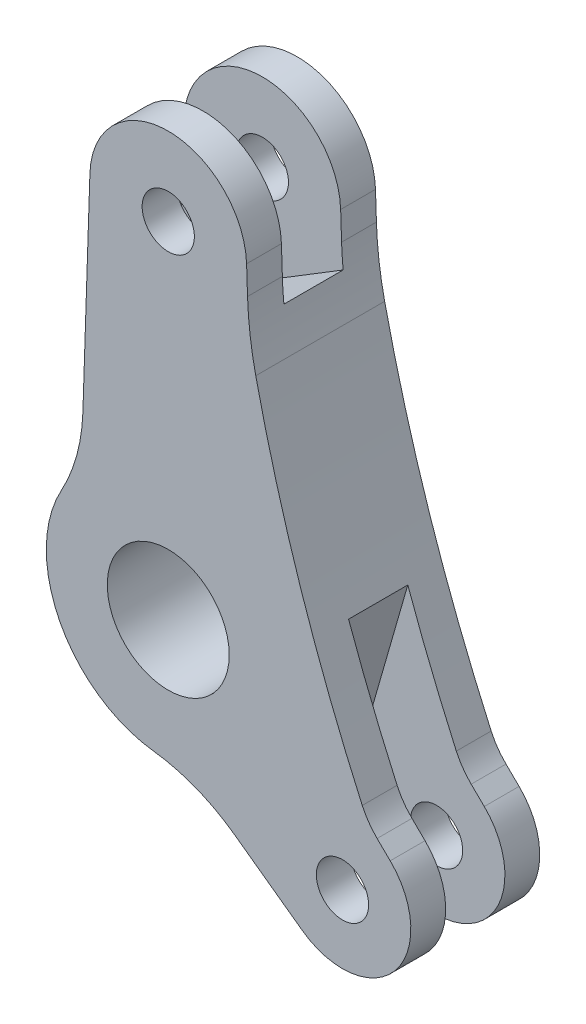
ISO-10303-21;
HEADER;
FILE_DESCRIPTION(('STEP AP214'),'2;1');
FILE_NAME('part.step','',(''),(''),'','','');
FILE_SCHEMA(('AUTOMOTIVE_DESIGN { 1 0 10303 214 1 1 1 1 }'));
ENDSEC;
DATA;
#1=APPLICATION_CONTEXT('core data for automotive mechanical design processes');
#2=APPLICATION_PROTOCOL_DEFINITION('international standard','automotive_design',2000,#1);
#3=PRODUCT_CONTEXT('',#1,'mechanical');
#4=PRODUCT('Part','Part','',(#3));
#5=PRODUCT_RELATED_PRODUCT_CATEGORY('part','',(#4));
#6=PRODUCT_DEFINITION_FORMATION('','',#4);
#7=PRODUCT_DEFINITION_CONTEXT('part definition',#1,'design');
#8=PRODUCT_DEFINITION('design','',#6,#7);
#9=PRODUCT_DEFINITION_SHAPE('','',#8);
#10=(LENGTH_UNIT() NAMED_UNIT(*) SI_UNIT(.MILLI.,.METRE.));
#11=(NAMED_UNIT(*) PLANE_ANGLE_UNIT() SI_UNIT($,.RADIAN.));
#12=(NAMED_UNIT(*) SI_UNIT($,.STERADIAN.) SOLID_ANGLE_UNIT());
#13=UNCERTAINTY_MEASURE_WITH_UNIT(LENGTH_MEASURE(1.E-05),#10,'distance_accuracy_value','');
#14=(GEOMETRIC_REPRESENTATION_CONTEXT(3) GLOBAL_UNCERTAINTY_ASSIGNED_CONTEXT((#13)) GLOBAL_UNIT_ASSIGNED_CONTEXT((#10,
#11,#12)) REPRESENTATION_CONTEXT('',''));
#15=CARTESIAN_POINT('',(0.,0.,0.));
#16=DIRECTION('',(0.,0.,1.));
#17=DIRECTION('',(1.,0.,0.));
#18=AXIS2_PLACEMENT_3D('',#15,#16,#17);
#19=CARTESIAN_POINT('',(1.89883544819038,-4.38734354159406,1.85));
#20=DIRECTION('',(0.586558009835035,0.809907217586288,0.));
#21=DIRECTION('',(-0.809907217586288,0.586558009835035,0.));
#22=AXIS2_PLACEMENT_3D('',#19,#20,#21);
#23=PLANE('',#22);
#24=DIRECTION('',(0.809907217586288,-0.586558009835035,0.));
#25=VECTOR('',#24,1.);
#26=CARTESIAN_POINT('',(1.89883544819038,-4.38734354159406,-0.85));
#27=LINE('',#26,#25);
#28=CARTESIAN_POINT('',(2.35712113183313,-4.7192471630169,-0.85));
#29=VERTEX_POINT('',#28);
#30=CARTESIAN_POINT('',(3.84954684208149,-5.80010461856446,-0.85));
#31=VERTEX_POINT('',#30);
#32=EDGE_CURVE('E246',#29,#31,#27,.T.);
#33=ORIENTED_EDGE('',*,*,#32,.F.);
#34=DIRECTION('',(0.,0.,1.));
#35=VECTOR('',#34,1.);
#36=CARTESIAN_POINT('',(2.35712113183313,-4.7192471630169,1.85));
#37=LINE('',#36,#35);
#38=CARTESIAN_POINT('',(2.35712113183313,-4.7192471630169,0.85));
#39=VERTEX_POINT('',#38);
#40=EDGE_CURVE('E208',#29,#39,#37,.T.);
#41=ORIENTED_EDGE('',*,*,#40,.T.);
#42=DIRECTION('',(0.809907217586288,-0.586558009835035,0.));
#43=VECTOR('',#42,1.);
#44=CARTESIAN_POINT('',(1.89883544819038,-4.38734354159406,0.85));
#45=LINE('',#44,#43);
#46=CARTESIAN_POINT('',(3.84954684208149,-5.80010461856446,0.85));
#47=VERTEX_POINT('',#46);
#48=EDGE_CURVE('E238',#39,#47,#45,.T.);
#49=ORIENTED_EDGE('',*,*,#48,.T.);
#50=DIRECTION('',(0.,0.,-1.));
#51=VECTOR('',#50,1.);
#52=CARTESIAN_POINT('',(3.84954684208149,-5.80010461856446,1.85));
#53=LINE('',#52,#51);
#54=CARTESIAN_POINT('',(3.84954684208149,-5.80010461856446,1.85));
#55=VERTEX_POINT('',#54);
#56=EDGE_CURVE('E43',#55,#47,#53,.T.);
#57=ORIENTED_EDGE('',*,*,#56,.F.);
#58=DIRECTION('',(0.809907217586288,-0.586558009835035,0.));
#59=VECTOR('',#58,1.);
#60=CARTESIAN_POINT('',(1.89883544819038,-4.38734354159406,1.85));
#61=LINE('',#60,#59);
#62=CARTESIAN_POINT('',(1.89883544819038,-4.38734354159406,1.85));
#63=VERTEX_POINT('',#62);
#64=EDGE_CURVE('E292',#63,#55,#61,.T.);
#65=ORIENTED_EDGE('',*,*,#64,.F.);
#66=DIRECTION('',(0.,0.,-1.));
#67=VECTOR('',#66,1.);
#68=CARTESIAN_POINT('',(1.89883544819038,-4.38734354159406,1.85));
#69=LINE('',#68,#67);
#70=CARTESIAN_POINT('',(1.89883544819038,-4.38734354159406,-1.85));
#71=VERTEX_POINT('',#70);
#72=EDGE_CURVE('E11',#63,#71,#69,.T.);
#73=ORIENTED_EDGE('',*,*,#72,.T.);
#74=DIRECTION('',(0.809907217586288,-0.586558009835035,0.));
#75=VECTOR('',#74,1.);
#76=CARTESIAN_POINT('',(1.89883544819038,-4.38734354159406,-1.85));
#77=LINE('',#76,#75);
#78=CARTESIAN_POINT('',(3.84954684208149,-5.80010461856446,-1.85));
#79=VERTEX_POINT('',#78);
#80=EDGE_CURVE('E318',#71,#79,#77,.T.);
#81=ORIENTED_EDGE('',*,*,#80,.T.);
#82=EDGE_CURVE('E380',#31,#79,#53,.T.);
#83=ORIENTED_EDGE('',*,*,#82,.F.);
#84=EDGE_LOOP('',(#33,#41,#49,#57,#65,#73,#81,#83));
#85=FACE_BOUND('',#84,.T.);
#86=ADVANCED_FACE('F34',(#85),#23,.F.);
#87=CARTESIAN_POINT('',(5.00079103651948,-4.21049034913888,1.85));
#88=DIRECTION('',(0.,0.,-1.));
#89=DIRECTION('',(-1.,0.,0.));
#90=AXIS2_PLACEMENT_3D('',#87,#88,#89);
#91=CYLINDRICAL_SURFACE('',#90,1.96271157350961);
#92=CARTESIAN_POINT('',(5.00079103651948,-4.21049034913888,-0.85));
#93=DIRECTION('',(0.,0.,1.));
#94=DIRECTION('',(1.,0.,0.));
#95=AXIS2_PLACEMENT_3D('',#92,#93,#94);
#96=CIRCLE('',#95,1.96271157350961);
#97=CARTESIAN_POINT('',(6.37107044623599,-2.80529603513973,-0.85));
#98=VERTEX_POINT('',#97);
#99=EDGE_CURVE('E244',#31,#98,#96,.T.);
#100=ORIENTED_EDGE('',*,*,#99,.F.);
#101=ORIENTED_EDGE('',*,*,#82,.T.);
#102=CARTESIAN_POINT('',(5.00079103651948,-4.21049034913888,-1.85));
#103=DIRECTION('',(0.,0.,1.));
#104=DIRECTION('',(1.,0.,0.));
#105=AXIS2_PLACEMENT_3D('',#102,#103,#104);
#106=CIRCLE('',#105,1.96271157350961);
#107=CARTESIAN_POINT('',(6.37107044623599,-2.80529603513973,-1.85));
#108=VERTEX_POINT('',#107);
#109=EDGE_CURVE('E321',#79,#108,#106,.T.);
#110=ORIENTED_EDGE('',*,*,#109,.T.);
#111=DIRECTION('',(0.,0.,-1.));
#112=VECTOR('',#111,1.);
#113=CARTESIAN_POINT('',(6.37107044623599,-2.80529603513973,1.85));
#114=LINE('',#113,#112);
#115=EDGE_CURVE('E376',#98,#108,#114,.T.);
#116=ORIENTED_EDGE('',*,*,#115,.F.);
#117=EDGE_LOOP('',(#100,#101,#110,#116));
#118=FACE_BOUND('',#117,.T.);
#119=ADVANCED_FACE('F419',(#118),#91,.T.);
#120=CARTESIAN_POINT('',(5.99474337438653,-2.43831957306836,1.85));
#121=DIRECTION('',(-0.698156279410047,-0.715945395627572,0.));
#122=DIRECTION('',(0.715945395627572,-0.698156279410047,0.));
#123=AXIS2_PLACEMENT_3D('',#120,#121,#122);
#124=PLANE('',#123);
#125=DIRECTION('',(-0.715945395627572,0.698156279410047,0.));
#126=VECTOR('',#125,1.);
#127=CARTESIAN_POINT('',(5.99474337438653,-2.43831957306836,-0.85));
#128=LINE('',#127,#126);
#129=CARTESIAN_POINT('',(5.99474337438653,-2.43831957306836,-0.85));
#130=VERTEX_POINT('',#129);
#131=EDGE_CURVE('E242',#98,#130,#128,.T.);
#132=ORIENTED_EDGE('',*,*,#131,.F.);
#133=ORIENTED_EDGE('',*,*,#115,.T.);
#134=DIRECTION('',(-0.715945395627572,0.698156279410047,0.));
#135=VECTOR('',#134,1.);
#136=CARTESIAN_POINT('',(5.99474337438653,-2.43831957306836,-1.85));
#137=LINE('',#136,#135);
#138=CARTESIAN_POINT('',(5.99474337438653,-2.43831957306836,-1.85));
#139=VERTEX_POINT('',#138);
#140=EDGE_CURVE('E324',#108,#139,#137,.T.);
#141=ORIENTED_EDGE('',*,*,#140,.T.);
#142=DIRECTION('',(0.,0.,-1.));
#143=VECTOR('',#142,1.);
#144=CARTESIAN_POINT('',(5.99474337438653,-2.43831957306836,1.85));
#145=LINE('',#144,#143);
#146=EDGE_CURVE('E372',#130,#139,#145,.T.);
#147=ORIENTED_EDGE('',*,*,#146,.F.);
#148=EDGE_LOOP('',(#132,#133,#141,#147));
#149=FACE_BOUND('',#148,.T.);
#150=ADVANCED_FACE('F424',(#149),#124,.F.);
#151=CARTESIAN_POINT('',(7.39105593320663,-1.00642878181321,1.85));
#152=DIRECTION('',(0.,0.,-1.));
#153=DIRECTION('',(-1.,0.,0.));
#154=AXIS2_PLACEMENT_3D('',#151,#152,#153);
#155=CYLINDRICAL_SURFACE('',#154,2.);
#156=CARTESIAN_POINT('',(7.39105593320663,-1.00642878181321,-0.85));
#157=DIRECTION('',(0.,0.,1.));
#158=DIRECTION('',(1.,0.,0.));
#159=AXIS2_PLACEMENT_3D('',#156,#157,#158);
#160=CIRCLE('',#159,2.);
#161=CARTESIAN_POINT('',(5.56845578497481,-1.82991448276097,-0.85));
#162=VERTEX_POINT('',#161);
#163=EDGE_CURVE('E197',#130,#162,#160,.F.);
#164=ORIENTED_EDGE('',*,*,#163,.F.);
#165=ORIENTED_EDGE('',*,*,#146,.T.);
#166=CARTESIAN_POINT('',(7.39105593320663,-1.00642878181321,-1.85));
#167=DIRECTION('',(0.,0.,-1.));
#168=DIRECTION('',(1.,0.,0.));
#169=AXIS2_PLACEMENT_3D('',#166,#167,#168);
#170=CIRCLE('',#169,2.);
#171=CARTESIAN_POINT('',(5.56845578497481,-1.82991448276097,-1.85));
#172=VERTEX_POINT('',#171);
#173=EDGE_CURVE('E327',#139,#172,#170,.T.);
#174=ORIENTED_EDGE('',*,*,#173,.T.);
#175=DIRECTION('',(0.,0.,-1.));
#176=VECTOR('',#175,1.);
#177=CARTESIAN_POINT('',(5.56845578497481,-1.82991448276097,1.85));
#178=LINE('',#177,#176);
#179=EDGE_CURVE('E369',#162,#172,#178,.T.);
#180=ORIENTED_EDGE('',*,*,#179,.F.);
#181=EDGE_LOOP('',(#164,#165,#174,#180));
#182=FACE_BOUND('',#181,.T.);
#183=ADVANCED_FACE('F440',(#182),#155,.F.);
#184=CARTESIAN_POINT('',(48.7361620669657,17.67408308929,1.85));
#185=DIRECTION('',(0.,0.,-1.));
#186=DIRECTION('',(-1.,0.,0.));
#187=AXIS2_PLACEMENT_3D('',#184,#185,#186);
#188=CYLINDRICAL_SURFACE('',#187,47.3693654901436);
#189=CARTESIAN_POINT('',(48.7361620669657,17.67408308929,-0.85));
#190=DIRECTION('',(0.,0.,1.));
#191=DIRECTION('',(1.,0.,0.));
#192=AXIS2_PLACEMENT_3D('',#189,#190,#191);
#193=CIRCLE('',#192,47.3693654901436);
#194=CARTESIAN_POINT('',(4.17602011367658,1.60390773114507,-0.85));
#195=VERTEX_POINT('',#194);
#196=EDGE_CURVE('E191',#162,#195,#193,.F.);
#197=ORIENTED_EDGE('',*,*,#196,.F.);
#198=ORIENTED_EDGE('',*,*,#179,.T.);
#199=CARTESIAN_POINT('',(48.7361620669657,17.67408308929,-1.85));
#200=DIRECTION('',(0.,0.,-1.));
#201=DIRECTION('',(1.,0.,0.));
#202=AXIS2_PLACEMENT_3D('',#199,#200,#201);
#203=CIRCLE('',#202,47.3693654901436);
#204=CARTESIAN_POINT('',(2.51157735789529,7.32301766524892,-1.85));
#205=VERTEX_POINT('',#204);
#206=EDGE_CURVE('E330',#172,#205,#203,.T.);
#207=ORIENTED_EDGE('',*,*,#206,.T.);
#208=DIRECTION('',(0.,0.,-1.));
#209=VECTOR('',#208,1.);
#210=CARTESIAN_POINT('',(2.51157735789529,7.32301766524892,1.85));
#211=LINE('',#210,#209);
#212=CARTESIAN_POINT('',(2.51157735789529,7.32301766524892,1.85));
#213=VERTEX_POINT('',#212);
#214=EDGE_CURVE('E366',#213,#205,#211,.T.);
#215=ORIENTED_EDGE('',*,*,#214,.F.);
#216=CARTESIAN_POINT('',(48.7361620669657,17.67408308929,1.85));
#217=DIRECTION('',(0.,0.,-1.));
#218=DIRECTION('',(1.,0.,0.));
#219=AXIS2_PLACEMENT_3D('',#216,#217,#218);
#220=CIRCLE('',#219,47.3693654901436);
#221=CARTESIAN_POINT('',(5.56845578497481,-1.82991448276097,1.85));
#222=VERTEX_POINT('',#221);
#223=EDGE_CURVE('E301',#222,#213,#220,.T.);
#224=ORIENTED_EDGE('',*,*,#223,.F.);
#225=CARTESIAN_POINT('',(5.56845578497481,-1.82991448276097,0.85));
#226=VERTEX_POINT('',#225);
#227=EDGE_CURVE('E370',#222,#226,#178,.T.);
#228=ORIENTED_EDGE('',*,*,#227,.T.);
#229=CARTESIAN_POINT('',(48.7361620669657,17.67408308929,0.85));
#230=DIRECTION('',(0.,0.,1.));
#231=DIRECTION('',(1.,0.,0.));
#232=AXIS2_PLACEMENT_3D('',#229,#230,#231);
#233=CIRCLE('',#232,47.3693654901436);
#234=CARTESIAN_POINT('',(4.17602011367658,1.60390773114507,0.85));
#235=VERTEX_POINT('',#234);
#236=EDGE_CURVE('E212',#226,#235,#233,.F.);
#237=ORIENTED_EDGE('',*,*,#236,.T.);
#238=DIRECTION('',(0.,0.,1.));
#239=VECTOR('',#238,1.);
#240=CARTESIAN_POINT('',(4.17602011367658,1.60390773114507,-0.85));
#241=LINE('',#240,#239);
#242=EDGE_CURVE('E205',#195,#235,#241,.T.);
#243=ORIENTED_EDGE('',*,*,#242,.F.);
#244=EDGE_LOOP('',(#197,#198,#207,#215,#224,#228,#237,#243));
#245=FACE_BOUND('',#244,.T.);
#246=ADVANCED_FACE('F210',(#245),#188,.F.);
#247=CARTESIAN_POINT('',(12.2699062336934,9.50819901968249,1.85));
#248=DIRECTION('',(0.,0.,-1.));
#249=DIRECTION('',(-1.,0.,0.));
#250=AXIS2_PLACEMENT_3D('',#247,#248,#249);
#251=CYLINDRICAL_SURFACE('',#250,10.);
#252=CARTESIAN_POINT('',(12.2699062336934,9.50819901968249,-0.85));
#253=DIRECTION('',(0.,0.,1.));
#254=DIRECTION('',(1.,0.,0.));
#255=AXIS2_PLACEMENT_3D('',#252,#253,#254);
#256=CIRCLE('',#255,10.);
#257=CARTESIAN_POINT('',(2.32019862464675,8.50654114671467,-0.85));
#258=VERTEX_POINT('',#257);
#259=CARTESIAN_POINT('',(2.27547486616742,9.17452007247119,-0.85));
#260=VERTEX_POINT('',#259);
#261=EDGE_CURVE('E267',#258,#260,#256,.F.);
#262=ORIENTED_EDGE('',*,*,#261,.F.);
#263=DIRECTION('',(0.,0.,1.));
#264=VECTOR('',#263,1.);
#265=CARTESIAN_POINT('',(2.32019862464675,8.50654114671467,-0.85));
#266=LINE('',#265,#264);
#267=CARTESIAN_POINT('',(2.32019862464675,8.50654114671467,0.85));
#268=VERTEX_POINT('',#267);
#269=EDGE_CURVE('E224',#258,#268,#266,.T.);
#270=ORIENTED_EDGE('',*,*,#269,.T.);
#271=CARTESIAN_POINT('',(12.2699062336934,9.50819901968249,0.85));
#272=DIRECTION('',(0.,0.,1.));
#273=DIRECTION('',(1.,0.,0.));
#274=AXIS2_PLACEMENT_3D('',#271,#272,#273);
#275=CIRCLE('',#274,10.);
#276=CARTESIAN_POINT('',(2.27547486616742,9.17452007247119,0.85));
#277=VERTEX_POINT('',#276);
#278=EDGE_CURVE('E258',#268,#277,#275,.F.);
#279=ORIENTED_EDGE('',*,*,#278,.T.);
#280=DIRECTION('',(0.,0.,-1.));
#281=VECTOR('',#280,1.);
#282=CARTESIAN_POINT('',(2.27547486616742,9.17452007247119,1.85));
#283=LINE('',#282,#281);
#284=CARTESIAN_POINT('',(2.27547486616742,9.17452007247119,1.85));
#285=VERTEX_POINT('',#284);
#286=EDGE_CURVE('E363',#285,#277,#283,.T.);
#287=ORIENTED_EDGE('',*,*,#286,.F.);
#288=CARTESIAN_POINT('',(12.2699062336934,9.50819901968249,1.85));
#289=DIRECTION('',(0.,0.,-1.));
#290=DIRECTION('',(-1.,0.,0.));
#291=AXIS2_PLACEMENT_3D('',#288,#289,#290);
#292=CIRCLE('',#291,10.);
#293=EDGE_CURVE('E303',#213,#285,#292,.T.);
#294=ORIENTED_EDGE('',*,*,#293,.F.);
#295=ORIENTED_EDGE('',*,*,#214,.T.);
#296=CARTESIAN_POINT('',(12.2699062336934,9.50819901968249,-1.85));
#297=DIRECTION('',(0.,0.,-1.));
#298=DIRECTION('',(-1.,0.,0.));
#299=AXIS2_PLACEMENT_3D('',#296,#297,#298);
#300=CIRCLE('',#299,10.);
#301=CARTESIAN_POINT('',(2.27547486616742,9.17452007247119,-1.85));
#302=VERTEX_POINT('',#301);
#303=EDGE_CURVE('E332',#205,#302,#300,.T.);
#304=ORIENTED_EDGE('',*,*,#303,.T.);
#305=EDGE_CURVE('E362',#260,#302,#283,.T.);
#306=ORIENTED_EDGE('',*,*,#305,.F.);
#307=EDGE_LOOP('',(#262,#270,#279,#287,#294,#295,#304,#306));
#308=FACE_BOUND('',#307,.T.);
#309=ADVANCED_FACE('F443',(#308),#251,.F.);
#310=CARTESIAN_POINT('',(2.24874705769335,9.97507776312254,1.85));
#311=DIRECTION('',(-0.999443136752602,-0.033367894721129,0.));
#312=DIRECTION('',(0.033367894721129,-0.999443136752602,0.));
#313=AXIS2_PLACEMENT_3D('',#310,#311,#312);
#314=PLANE('',#313);
#315=DIRECTION('',(-0.033367894721129,0.999443136752602,0.));
#316=VECTOR('',#315,1.);
#317=CARTESIAN_POINT('',(2.24874705769335,9.97507776312254,-0.85));
#318=LINE('',#317,#316);
#319=CARTESIAN_POINT('',(2.24874705769335,9.97507776312254,-0.85));
#320=VERTEX_POINT('',#319);
#321=EDGE_CURVE('E265',#260,#320,#318,.T.);
#322=ORIENTED_EDGE('',*,*,#321,.F.);
#323=ORIENTED_EDGE('',*,*,#305,.T.);
#324=DIRECTION('',(-0.033367894721129,0.999443136752602,0.));
#325=VECTOR('',#324,1.);
#326=CARTESIAN_POINT('',(2.24874705769335,9.97507776312254,-1.85));
#327=LINE('',#326,#325);
#328=CARTESIAN_POINT('',(2.24874705769335,9.97507776312254,-1.85));
#329=VERTEX_POINT('',#328);
#330=EDGE_CURVE('E335',#302,#329,#327,.T.);
#331=ORIENTED_EDGE('',*,*,#330,.T.);
#332=DIRECTION('',(0.,0.,-1.));
#333=VECTOR('',#332,1.);
#334=CARTESIAN_POINT('',(2.24874705769335,9.97507776312254,1.85));
#335=LINE('',#334,#333);
#336=EDGE_CURVE('E358',#320,#329,#335,.T.);
#337=ORIENTED_EDGE('',*,*,#336,.F.);
#338=EDGE_LOOP('',(#322,#323,#331,#337));
#339=FACE_BOUND('',#338,.T.);
#340=ADVANCED_FACE('F446',(#339),#314,.F.);
#341=CARTESIAN_POINT('',(0.,9.9,1.85));
#342=DIRECTION('',(0.,0.,-1.));
#343=DIRECTION('',(-1.,0.,0.));
#344=AXIS2_PLACEMENT_3D('',#341,#342,#343);
#345=CYLINDRICAL_SURFACE('',#344,2.25);
#346=CARTESIAN_POINT('',(0.,9.9,-0.85));
#347=DIRECTION('',(0.,0.,1.));
#348=DIRECTION('',(1.,0.,0.));
#349=AXIS2_PLACEMENT_3D('',#346,#347,#348);
#350=CIRCLE('',#349,2.25);
#351=CARTESIAN_POINT('',(-2.24874705769335,9.97507776312254,-0.85));
#352=VERTEX_POINT('',#351);
#353=EDGE_CURVE('E263',#320,#352,#350,.T.);
#354=ORIENTED_EDGE('',*,*,#353,.F.);
#355=ORIENTED_EDGE('',*,*,#336,.T.);
#356=CARTESIAN_POINT('',(0.,9.9,-1.85));
#357=DIRECTION('',(0.,0.,1.));
#358=DIRECTION('',(-1.,0.,0.));
#359=AXIS2_PLACEMENT_3D('',#356,#357,#358);
#360=CIRCLE('',#359,2.25);
#361=CARTESIAN_POINT('',(-2.24874705769335,9.97507776312254,-1.85));
#362=VERTEX_POINT('',#361);
#363=EDGE_CURVE('E338',#329,#362,#360,.T.);
#364=ORIENTED_EDGE('',*,*,#363,.T.);
#365=DIRECTION('',(0.,0.,-1.));
#366=VECTOR('',#365,1.);
#367=CARTESIAN_POINT('',(-2.24874705769335,9.97507776312254,1.85));
#368=LINE('',#367,#366);
#369=EDGE_CURVE('E354',#352,#362,#368,.T.);
#370=ORIENTED_EDGE('',*,*,#369,.F.);
#371=EDGE_LOOP('',(#354,#355,#364,#370));
#372=FACE_BOUND('',#371,.T.);
#373=ADVANCED_FACE('F456',(#372),#345,.T.);
#374=CARTESIAN_POINT('',(-2.24874705769335,9.97507776312254,1.85));
#375=DIRECTION('',(0.999443136752602,-0.0333678947211292,0.));
#376=DIRECTION('',(0.0333678947211292,0.999443136752602,0.));
#377=AXIS2_PLACEMENT_3D('',#374,#375,#376);
#378=PLANE('',#377);
#379=DIRECTION('',(-0.0333678947211292,-0.999443136752602,0.));
#380=VECTOR('',#379,1.);
#381=CARTESIAN_POINT('',(-2.24874705769335,9.97507776312254,-0.85));
#382=LINE('',#381,#380);
#383=CARTESIAN_POINT('',(-2.39415597007872,5.61975535753527,-0.85));
#384=VERTEX_POINT('',#383);
#385=EDGE_CURVE('E261',#352,#384,#382,.T.);
#386=ORIENTED_EDGE('',*,*,#385,.F.);
#387=ORIENTED_EDGE('',*,*,#369,.T.);
#388=DIRECTION('',(-0.0333678947211292,-0.999443136752602,0.));
#389=VECTOR('',#388,1.);
#390=CARTESIAN_POINT('',(-2.24874705769335,9.97507776312254,-1.85));
#391=LINE('',#390,#389);
#392=CARTESIAN_POINT('',(-2.45058666713269,3.92952966771848,-1.85));
#393=VERTEX_POINT('',#392);
#394=EDGE_CURVE('E341',#362,#393,#391,.T.);
#395=ORIENTED_EDGE('',*,*,#394,.T.);
#396=DIRECTION('',(0.,0.,-1.));
#397=VECTOR('',#396,1.);
#398=CARTESIAN_POINT('',(-2.45058666713269,3.92952966771848,1.85));
#399=LINE('',#398,#397);
#400=CARTESIAN_POINT('',(-2.45058666713269,3.92952966771848,1.85));
#401=VERTEX_POINT('',#400);
#402=EDGE_CURVE('E351',#401,#393,#399,.T.);
#403=ORIENTED_EDGE('',*,*,#402,.F.);
#404=DIRECTION('',(-0.0333678947211292,-0.999443136752602,0.));
#405=VECTOR('',#404,1.);
#406=CARTESIAN_POINT('',(-2.24874705769335,9.97507776312254,1.85));
#407=LINE('',#406,#405);
#408=CARTESIAN_POINT('',(-2.24874705769335,9.97507776312254,1.85));
#409=VERTEX_POINT('',#408);
#410=EDGE_CURVE('E309',#409,#401,#407,.T.);
#411=ORIENTED_EDGE('',*,*,#410,.F.);
#412=CARTESIAN_POINT('',(-2.24874705769335,9.97507776312254,0.85));
#413=VERTEX_POINT('',#412);
#414=EDGE_CURVE('E355',#409,#413,#368,.T.);
#415=ORIENTED_EDGE('',*,*,#414,.T.);
#416=DIRECTION('',(-0.0333678947211292,-0.999443136752602,0.));
#417=VECTOR('',#416,1.);
#418=CARTESIAN_POINT('',(-2.24874705769335,9.97507776312254,0.85));
#419=LINE('',#418,#417);
#420=CARTESIAN_POINT('',(-2.39415597007872,5.61975535753527,0.85));
#421=VERTEX_POINT('',#420);
#422=EDGE_CURVE('E249',#413,#421,#419,.T.);
#423=ORIENTED_EDGE('',*,*,#422,.T.);
#424=DIRECTION('',(0.,0.,1.));
#425=VECTOR('',#424,1.);
#426=CARTESIAN_POINT('',(-2.39415597007872,5.61975535753527,-0.85));
#427=LINE('',#426,#425);
#428=EDGE_CURVE('E222',#384,#421,#427,.T.);
#429=ORIENTED_EDGE('',*,*,#428,.F.);
#430=EDGE_LOOP('',(#386,#387,#395,#403,#411,#415,#423,#429));
#431=FACE_BOUND('',#430,.T.);
#432=ADVANCED_FACE('F457',(#431),#378,.F.);
#433=CARTESIAN_POINT('',(0.,9.9,1.85));
#434=DIRECTION('',(0.,0.,-1.));
#435=DIRECTION('',(-1.,0.,0.));
#436=AXIS2_PLACEMENT_3D('',#433,#434,#435);
#437=CYLINDRICAL_SURFACE('',#436,0.749999999999999);
#438=CARTESIAN_POINT('',(0.,9.9,-1.85));
#439=DIRECTION('',(0.,0.,1.));
#440=DIRECTION('',(1.,0.,0.));
#441=AXIS2_PLACEMENT_3D('',#438,#439,#440);
#442=CIRCLE('',#441,0.749999999999999);
#443=CARTESIAN_POINT('',(0.749999999999999,9.9,-1.85));
#444=VERTEX_POINT('',#443);
#445=EDGE_CURVE('E274',#444,#444,#442,.T.);
#446=ORIENTED_EDGE('',*,*,#445,.F.);
#447=EDGE_LOOP('',(#446));
#448=FACE_BOUND('',#447,.T.);
#449=CARTESIAN_POINT('',(0.,9.9,-0.85));
#450=DIRECTION('',(0.,0.,1.));
#451=DIRECTION('',(1.,0.,0.));
#452=AXIS2_PLACEMENT_3D('',#449,#450,#451);
#453=CIRCLE('',#452,0.749999999999999);
#454=CARTESIAN_POINT('',(0.749999999999999,9.9,-0.85));
#455=VERTEX_POINT('',#454);
#456=EDGE_CURVE('E38',#455,#455,#453,.T.);
#457=ORIENTED_EDGE('',*,*,#456,.T.);
#458=EDGE_LOOP('',(#457));
#459=FACE_BOUND('',#458,.T.);
#460=ADVANCED_FACE('F395',(#448,#459),#437,.F.);
#461=CARTESIAN_POINT('',(5.00079103651948,-4.21049034913888,1.85));
#462=DIRECTION('',(0.,0.,-1.));
#463=DIRECTION('',(-1.,0.,0.));
#464=AXIS2_PLACEMENT_3D('',#461,#462,#463);
#465=CYLINDRICAL_SURFACE('',#464,0.749999999999998);
#466=CARTESIAN_POINT('',(5.00079103651948,-4.21049034913888,-1.85));
#467=DIRECTION('',(0.,0.,1.));
#468=DIRECTION('',(1.,0.,0.));
#469=AXIS2_PLACEMENT_3D('',#466,#467,#468);
#470=CIRCLE('',#469,0.749999999999998);
#471=CARTESIAN_POINT('',(5.75079103651948,-4.21049034913888,-1.85));
#472=VERTEX_POINT('',#471);
#473=EDGE_CURVE('E270',#472,#472,#470,.T.);
#474=ORIENTED_EDGE('',*,*,#473,.F.);
#475=EDGE_LOOP('',(#474));
#476=FACE_BOUND('',#475,.T.);
#477=CARTESIAN_POINT('',(5.00079103651948,-4.21049034913888,-0.85));
#478=DIRECTION('',(0.,0.,1.));
#479=DIRECTION('',(1.,0.,0.));
#480=AXIS2_PLACEMENT_3D('',#477,#478,#479);
#481=CIRCLE('',#480,0.749999999999998);
#482=CARTESIAN_POINT('',(5.75079103651948,-4.21049034913888,-0.85));
#483=VERTEX_POINT('',#482);
#484=EDGE_CURVE('E201',#483,#483,#481,.T.);
#485=ORIENTED_EDGE('',*,*,#484,.T.);
#486=EDGE_LOOP('',(#485));
#487=FACE_BOUND('',#486,.T.);
#488=ADVANCED_FACE('F402',(#476,#487),#465,.F.);
#489=CARTESIAN_POINT('',(-1.0339546009848,-8.4368796295255,1.85));
#490=DIRECTION('',(0.,0.,-1.));
#491=DIRECTION('',(-1.,0.,0.));
#492=AXIS2_PLACEMENT_3D('',#489,#490,#491);
#493=PLANE('',#492);
#494=CARTESIAN_POINT('',(-1.0339546009848,-8.4368796295255,1.85));
#495=DIRECTION('',(0.,0.,-1.));
#496=DIRECTION('',(-1.,0.,0.));
#497=AXIS2_PLACEMENT_3D('',#494,#495,#496);
#498=CIRCLE('',#497,5.);
#499=CARTESIAN_POINT('',(-0.425746012170211,-3.47400925921638,1.85));
#500=VERTEX_POINT('',#499);
#501=EDGE_CURVE('E289',#500,#63,#498,.T.);
#502=ORIENTED_EDGE('',*,*,#501,.T.);
#503=ORIENTED_EDGE('',*,*,#64,.T.);
#504=CARTESIAN_POINT('',(5.00079103651948,-4.21049034913888,1.85));
#505=DIRECTION('',(0.,0.,1.));
#506=DIRECTION('',(1.,0.,0.));
#507=AXIS2_PLACEMENT_3D('',#504,#505,#506);
#508=CIRCLE('',#507,1.96271157350961);
#509=CARTESIAN_POINT('',(6.37107044623599,-2.80529603513973,1.85));
#510=VERTEX_POINT('',#509);
#511=EDGE_CURVE('E295',#55,#510,#508,.T.);
#512=ORIENTED_EDGE('',*,*,#511,.T.);
#513=DIRECTION('',(-0.715945395627572,0.698156279410047,0.));
#514=VECTOR('',#513,1.);
#515=CARTESIAN_POINT('',(5.99474337438653,-2.43831957306836,1.85));
#516=LINE('',#515,#514);
#517=CARTESIAN_POINT('',(5.99474337438653,-2.43831957306836,1.85));
#518=VERTEX_POINT('',#517);
#519=EDGE_CURVE('E297',#510,#518,#516,.T.);
#520=ORIENTED_EDGE('',*,*,#519,.T.);
#521=CARTESIAN_POINT('',(7.39105593320663,-1.00642878181321,1.85));
#522=DIRECTION('',(0.,0.,-1.));
#523=DIRECTION('',(1.,0.,0.));
#524=AXIS2_PLACEMENT_3D('',#521,#522,#523);
#525=CIRCLE('',#524,2.);
#526=EDGE_CURVE('E299',#518,#222,#525,.T.);
#527=ORIENTED_EDGE('',*,*,#526,.T.);
#528=ORIENTED_EDGE('',*,*,#223,.T.);
#529=ORIENTED_EDGE('',*,*,#293,.T.);
#530=DIRECTION('',(-0.033367894721129,0.999443136752602,0.));
#531=VECTOR('',#530,1.);
#532=CARTESIAN_POINT('',(2.24874705769335,9.97507776312254,1.85));
#533=LINE('',#532,#531);
#534=CARTESIAN_POINT('',(2.24874705769335,9.97507776312254,1.85));
#535=VERTEX_POINT('',#534);
#536=EDGE_CURVE('E305',#285,#535,#533,.T.);
#537=ORIENTED_EDGE('',*,*,#536,.T.);
#538=CARTESIAN_POINT('',(0.,9.9,1.85));
#539=DIRECTION('',(0.,0.,1.));
#540=DIRECTION('',(-1.,0.,0.));
#541=AXIS2_PLACEMENT_3D('',#538,#539,#540);
#542=CIRCLE('',#541,2.25);
#543=EDGE_CURVE('E307',#535,#409,#542,.T.);
#544=ORIENTED_EDGE('',*,*,#543,.T.);
#545=ORIENTED_EDGE('',*,*,#410,.T.);
#546=CARTESIAN_POINT('',(-7.44780235089569,4.09636914132413,1.85));
#547=DIRECTION('',(0.,0.,-1.));
#548=DIRECTION('',(-1.,0.,0.));
#549=AXIS2_PLACEMENT_3D('',#546,#547,#548);
#550=CIRCLE('',#549,5.);
#551=CARTESIAN_POINT('',(-3.06674214448646,1.68674023466288,1.85));
#552=VERTEX_POINT('',#551);
#553=EDGE_CURVE('E311',#401,#552,#550,.T.);
#554=ORIENTED_EDGE('',*,*,#553,.T.);
#555=CARTESIAN_POINT('',(0.,0.,1.85));
#556=DIRECTION('',(0.,0.,1.));
#557=DIRECTION('',(1.,0.,0.));
#558=AXIS2_PLACEMENT_3D('',#555,#556,#557);
#559=CIRCLE('',#558,3.5);
#560=EDGE_CURVE('E313',#552,#500,#559,.T.);
#561=ORIENTED_EDGE('',*,*,#560,.T.);
#562=EDGE_LOOP('',(#502,#503,#512,#520,#527,#528,#529,#537,#544,#545,#554,#561));
#563=FACE_BOUND('',#562,.T.);
#564=CARTESIAN_POINT('',(0.,0.,1.85));
#565=DIRECTION('',(0.,0.,1.));
#566=DIRECTION('',(1.,0.,0.));
#567=AXIS2_PLACEMENT_3D('',#564,#565,#566);
#568=CIRCLE('',#567,1.75);
#569=CARTESIAN_POINT('',(1.75,0.,1.85));
#570=VERTEX_POINT('',#569);
#571=EDGE_CURVE('E283',#570,#570,#568,.T.);
#572=ORIENTED_EDGE('',*,*,#571,.F.);
#573=EDGE_LOOP('',(#572));
#574=FACE_BOUND('',#573,.T.);
#575=CARTESIAN_POINT('',(0.,9.9,1.85));
#576=DIRECTION('',(0.,0.,1.));
#577=DIRECTION('',(1.,0.,0.));
#578=AXIS2_PLACEMENT_3D('',#575,#576,#577);
#579=CIRCLE('',#578,0.749999999999999);
#580=CARTESIAN_POINT('',(0.749999999999999,9.9,1.85));
#581=VERTEX_POINT('',#580);
#582=EDGE_CURVE('E277',#581,#581,#579,.T.);
#583=ORIENTED_EDGE('',*,*,#582,.F.);
#584=EDGE_LOOP('',(#583));
#585=FACE_BOUND('',#584,.T.);
#586=CARTESIAN_POINT('',(5.00079103651948,-4.21049034913888,1.85));
#587=DIRECTION('',(0.,0.,1.));
#588=DIRECTION('',(1.,0.,0.));
#589=AXIS2_PLACEMENT_3D('',#586,#587,#588);
#590=CIRCLE('',#589,0.749999999999998);
#591=CARTESIAN_POINT('',(5.75079103651948,-4.21049034913888,1.85));
#592=VERTEX_POINT('',#591);
#593=EDGE_CURVE('E271',#592,#592,#590,.T.);
#594=ORIENTED_EDGE('',*,*,#593,.F.);
#595=EDGE_LOOP('',(#594));
#596=FACE_BOUND('',#595,.T.);
#597=ADVANCED_FACE('F398',(#563,#574,#585,#596),#493,.F.);
#598=CARTESIAN_POINT('',(-1.0339546009848,-8.4368796295255,-1.85));
#599=DIRECTION('',(0.,0.,-1.));
#600=DIRECTION('',(-1.,0.,0.));
#601=AXIS2_PLACEMENT_3D('',#598,#599,#600);
#602=PLANE('',#601);
#603=ORIENTED_EDGE('',*,*,#445,.T.);
#604=EDGE_LOOP('',(#603));
#605=FACE_BOUND('',#604,.T.);
#606=CARTESIAN_POINT('',(-1.0339546009848,-8.4368796295255,-1.85));
#607=DIRECTION('',(0.,0.,-1.));
#608=DIRECTION('',(-1.,0.,0.));
#609=AXIS2_PLACEMENT_3D('',#606,#607,#608);
#610=CIRCLE('',#609,5.);
#611=CARTESIAN_POINT('',(-0.425746012170211,-3.47400925921638,-1.85));
#612=VERTEX_POINT('',#611);
#613=EDGE_CURVE('E286',#612,#71,#610,.T.);
#614=ORIENTED_EDGE('',*,*,#613,.F.);
#615=CARTESIAN_POINT('',(0.,0.,-1.85));
#616=DIRECTION('',(0.,0.,1.));
#617=DIRECTION('',(1.,0.,0.));
#618=AXIS2_PLACEMENT_3D('',#615,#616,#617);
#619=CIRCLE('',#618,3.5);
#620=CARTESIAN_POINT('',(-3.06674214448646,1.68674023466288,-1.85));
#621=VERTEX_POINT('',#620);
#622=EDGE_CURVE('E293',#621,#612,#619,.T.);
#623=ORIENTED_EDGE('',*,*,#622,.F.);
#624=CARTESIAN_POINT('',(-7.44780235089569,4.09636914132413,-1.85));
#625=DIRECTION('',(0.,0.,-1.));
#626=DIRECTION('',(-1.,0.,0.));
#627=AXIS2_PLACEMENT_3D('',#624,#625,#626);
#628=CIRCLE('',#627,5.);
#629=EDGE_CURVE('E343',#393,#621,#628,.T.);
#630=ORIENTED_EDGE('',*,*,#629,.F.);
#631=ORIENTED_EDGE('',*,*,#394,.F.);
#632=ORIENTED_EDGE('',*,*,#363,.F.);
#633=ORIENTED_EDGE('',*,*,#330,.F.);
#634=ORIENTED_EDGE('',*,*,#303,.F.);
#635=ORIENTED_EDGE('',*,*,#206,.F.);
#636=ORIENTED_EDGE('',*,*,#173,.F.);
#637=ORIENTED_EDGE('',*,*,#140,.F.);
#638=ORIENTED_EDGE('',*,*,#109,.F.);
#639=ORIENTED_EDGE('',*,*,#80,.F.);
#640=EDGE_LOOP('',(#614,#623,#630,#631,#632,#633,#634,#635,#636,#637,#638,#639));
#641=FACE_BOUND('',#640,.T.);
#642=CARTESIAN_POINT('',(0.,0.,-1.85));
#643=DIRECTION('',(0.,0.,1.));
#644=DIRECTION('',(1.,0.,0.));
#645=AXIS2_PLACEMENT_3D('',#642,#643,#644);
#646=CIRCLE('',#645,1.75);
#647=CARTESIAN_POINT('',(1.75,0.,-1.85));
#648=VERTEX_POINT('',#647);
#649=EDGE_CURVE('E280',#648,#648,#646,.T.);
#650=ORIENTED_EDGE('',*,*,#649,.T.);
#651=EDGE_LOOP('',(#650));
#652=FACE_BOUND('',#651,.T.);
#653=ORIENTED_EDGE('',*,*,#473,.T.);
#654=EDGE_LOOP('',(#653));
#655=FACE_BOUND('',#654,.T.);
#656=ADVANCED_FACE('F401',(#605,#641,#652,#655),#602,.T.);
#657=CARTESIAN_POINT('',(-1.0339546009848,-8.4368796295255,1.85));
#658=DIRECTION('',(0.,0.,-1.));
#659=DIRECTION('',(-1.,0.,0.));
#660=AXIS2_PLACEMENT_3D('',#657,#658,#659);
#661=CYLINDRICAL_SURFACE('',#660,5.);
#662=ORIENTED_EDGE('',*,*,#613,.T.);
#663=ORIENTED_EDGE('',*,*,#72,.F.);
#664=ORIENTED_EDGE('',*,*,#501,.F.);
#665=DIRECTION('',(0.,0.,-1.));
#666=VECTOR('',#665,1.);
#667=CARTESIAN_POINT('',(-0.425746012170211,-3.47400925921638,1.85));
#668=LINE('',#667,#666);
#669=EDGE_CURVE('E315',#500,#612,#668,.T.);
#670=ORIENTED_EDGE('',*,*,#669,.T.);
#671=EDGE_LOOP('',(#662,#663,#664,#670));
#672=FACE_BOUND('',#671,.T.);
#673=ADVANCED_FACE('F36',(#672),#661,.F.);
#674=ORIENTED_EDGE('',*,*,#56,.T.);
#675=CARTESIAN_POINT('',(5.00079103651948,-4.21049034913888,0.85));
#676=DIRECTION('',(0.,0.,1.));
#677=DIRECTION('',(1.,0.,0.));
#678=AXIS2_PLACEMENT_3D('',#675,#676,#677);
#679=CIRCLE('',#678,1.96271157350961);
#680=CARTESIAN_POINT('',(6.37107044623599,-2.80529603513973,0.85));
#681=VERTEX_POINT('',#680);
#682=EDGE_CURVE('E235',#47,#681,#679,.T.);
#683=ORIENTED_EDGE('',*,*,#682,.T.);
#684=EDGE_CURVE('E377',#510,#681,#114,.T.);
#685=ORIENTED_EDGE('',*,*,#684,.F.);
#686=ORIENTED_EDGE('',*,*,#511,.F.);
#687=EDGE_LOOP('',(#674,#683,#685,#686));
#688=FACE_BOUND('',#687,.T.);
#689=ADVANCED_FACE('F427',(#688),#91,.T.);
#690=ORIENTED_EDGE('',*,*,#684,.T.);
#691=DIRECTION('',(-0.715945395627572,0.698156279410047,0.));
#692=VECTOR('',#691,1.);
#693=CARTESIAN_POINT('',(5.99474337438653,-2.43831957306836,0.85));
#694=LINE('',#693,#692);
#695=CARTESIAN_POINT('',(5.99474337438653,-2.43831957306836,0.85));
#696=VERTEX_POINT('',#695);
#697=EDGE_CURVE('E232',#681,#696,#694,.T.);
#698=ORIENTED_EDGE('',*,*,#697,.T.);
#699=EDGE_CURVE('E373',#518,#696,#145,.T.);
#700=ORIENTED_EDGE('',*,*,#699,.F.);
#701=ORIENTED_EDGE('',*,*,#519,.F.);
#702=EDGE_LOOP('',(#690,#698,#700,#701));
#703=FACE_BOUND('',#702,.T.);
#704=ADVANCED_FACE('F430',(#703),#124,.F.);
#705=ORIENTED_EDGE('',*,*,#699,.T.);
#706=CARTESIAN_POINT('',(7.39105593320663,-1.00642878181321,0.85));
#707=DIRECTION('',(0.,0.,1.));
#708=DIRECTION('',(1.,0.,0.));
#709=AXIS2_PLACEMENT_3D('',#706,#707,#708);
#710=CIRCLE('',#709,2.);
#711=EDGE_CURVE('E229',#696,#226,#710,.F.);
#712=ORIENTED_EDGE('',*,*,#711,.T.);
#713=ORIENTED_EDGE('',*,*,#227,.F.);
#714=ORIENTED_EDGE('',*,*,#526,.F.);
#715=EDGE_LOOP('',(#705,#712,#713,#714));
#716=FACE_BOUND('',#715,.T.);
#717=ADVANCED_FACE('F434',(#716),#155,.F.);
#718=ORIENTED_EDGE('',*,*,#286,.T.);
#719=DIRECTION('',(-0.033367894721129,0.999443136752602,0.));
#720=VECTOR('',#719,1.);
#721=CARTESIAN_POINT('',(2.24874705769335,9.97507776312254,0.85));
#722=LINE('',#721,#720);
#723=CARTESIAN_POINT('',(2.24874705769335,9.97507776312254,0.85));
#724=VERTEX_POINT('',#723);
#725=EDGE_CURVE('E255',#277,#724,#722,.T.);
#726=ORIENTED_EDGE('',*,*,#725,.T.);
#727=EDGE_CURVE('E359',#535,#724,#335,.T.);
#728=ORIENTED_EDGE('',*,*,#727,.F.);
#729=ORIENTED_EDGE('',*,*,#536,.F.);
#730=EDGE_LOOP('',(#718,#726,#728,#729));
#731=FACE_BOUND('',#730,.T.);
#732=ADVANCED_FACE('F438',(#731),#314,.F.);
#733=ORIENTED_EDGE('',*,*,#727,.T.);
#734=CARTESIAN_POINT('',(0.,9.9,0.85));
#735=DIRECTION('',(0.,0.,1.));
#736=DIRECTION('',(1.,0.,0.));
#737=AXIS2_PLACEMENT_3D('',#734,#735,#736);
#738=CIRCLE('',#737,2.25);
#739=EDGE_CURVE('E252',#724,#413,#738,.T.);
#740=ORIENTED_EDGE('',*,*,#739,.T.);
#741=ORIENTED_EDGE('',*,*,#414,.F.);
#742=ORIENTED_EDGE('',*,*,#543,.F.);
#743=EDGE_LOOP('',(#733,#740,#741,#742));
#744=FACE_BOUND('',#743,.T.);
#745=ADVANCED_FACE('F450',(#744),#345,.T.);
#746=CARTESIAN_POINT('',(-7.44780235089569,4.09636914132413,1.85));
#747=DIRECTION('',(0.,0.,-1.));
#748=DIRECTION('',(-1.,0.,0.));
#749=AXIS2_PLACEMENT_3D('',#746,#747,#748);
#750=CYLINDRICAL_SURFACE('',#749,5.);
#751=ORIENTED_EDGE('',*,*,#629,.T.);
#752=DIRECTION('',(0.,0.,-1.));
#753=VECTOR('',#752,1.);
#754=CARTESIAN_POINT('',(-3.06674214448646,1.68674023466288,1.85));
#755=LINE('',#754,#753);
#756=EDGE_CURVE('E348',#552,#621,#755,.T.);
#757=ORIENTED_EDGE('',*,*,#756,.F.);
#758=ORIENTED_EDGE('',*,*,#553,.F.);
#759=ORIENTED_EDGE('',*,*,#402,.T.);
#760=EDGE_LOOP('',(#751,#757,#758,#759));
#761=FACE_BOUND('',#760,.T.);
#762=ADVANCED_FACE('F454',(#761),#750,.F.);
#763=CARTESIAN_POINT('',(0.,0.,1.85));
#764=DIRECTION('',(0.,0.,-1.));
#765=DIRECTION('',(-1.,0.,0.));
#766=AXIS2_PLACEMENT_3D('',#763,#764,#765);
#767=CYLINDRICAL_SURFACE('',#766,3.5);
#768=ORIENTED_EDGE('',*,*,#622,.T.);
#769=ORIENTED_EDGE('',*,*,#669,.F.);
#770=ORIENTED_EDGE('',*,*,#560,.F.);
#771=ORIENTED_EDGE('',*,*,#756,.T.);
#772=EDGE_LOOP('',(#768,#769,#770,#771));
#773=FACE_BOUND('',#772,.T.);
#774=ADVANCED_FACE('F463',(#773),#767,.T.);
#775=CARTESIAN_POINT('',(0.,0.,1.85));
#776=DIRECTION('',(0.,0.,-1.));
#777=DIRECTION('',(-1.,0.,0.));
#778=AXIS2_PLACEMENT_3D('',#775,#776,#777);
#779=CYLINDRICAL_SURFACE('',#778,1.75);
#780=ORIENTED_EDGE('',*,*,#571,.T.);
#781=EDGE_LOOP('',(#780));
#782=FACE_BOUND('',#781,.T.);
#783=ORIENTED_EDGE('',*,*,#649,.F.);
#784=EDGE_LOOP('',(#783));
#785=FACE_BOUND('',#784,.T.);
#786=ADVANCED_FACE('F393',(#782,#785),#779,.F.);
#787=CARTESIAN_POINT('',(0.,9.9,0.85));
#788=DIRECTION('',(0.,0.,1.));
#789=DIRECTION('',(1.,0.,0.));
#790=AXIS2_PLACEMENT_3D('',#787,#788,#789);
#791=CIRCLE('',#790,0.749999999999999);
#792=CARTESIAN_POINT('',(0.749999999999999,9.9,0.85));
#793=VERTEX_POINT('',#792);
#794=EDGE_CURVE('E248',#793,#793,#791,.T.);
#795=ORIENTED_EDGE('',*,*,#794,.F.);
#796=EDGE_LOOP('',(#795));
#797=FACE_BOUND('',#796,.T.);
#798=ORIENTED_EDGE('',*,*,#582,.T.);
#799=EDGE_LOOP('',(#798));
#800=FACE_BOUND('',#799,.T.);
#801=ADVANCED_FACE('F389',(#797,#800),#437,.F.);
#802=CARTESIAN_POINT('',(5.00079103651948,-4.21049034913888,0.85));
#803=DIRECTION('',(0.,0.,1.));
#804=DIRECTION('',(1.,0.,0.));
#805=AXIS2_PLACEMENT_3D('',#802,#803,#804);
#806=CIRCLE('',#805,0.749999999999998);
#807=CARTESIAN_POINT('',(5.75079103651948,-4.21049034913888,0.85));
#808=VERTEX_POINT('',#807);
#809=EDGE_CURVE('E213',#808,#808,#806,.T.);
#810=ORIENTED_EDGE('',*,*,#809,.F.);
#811=EDGE_LOOP('',(#810));
#812=FACE_BOUND('',#811,.T.);
#813=ORIENTED_EDGE('',*,*,#593,.T.);
#814=EDGE_LOOP('',(#813));
#815=FACE_BOUND('',#814,.T.);
#816=ADVANCED_FACE('F392',(#812,#815),#465,.F.);
#817=CARTESIAN_POINT('',(1.70493804516545,-6.98647295043966,-0.85));
#818=DIRECTION('',(-0.961029258850753,0.276446674121379,0.));
#819=DIRECTION('',(-0.276446674121379,-0.961029258850753,0.));
#820=AXIS2_PLACEMENT_3D('',#817,#818,#819);
#821=PLANE('',#820);
#822=DIRECTION('',(-0.276446674121379,-0.961029258850753,0.));
#823=VECTOR('',#822,1.);
#824=CARTESIAN_POINT('',(1.70493804516545,-6.98647295043966,-0.85));
#825=LINE('',#824,#823);
#826=EDGE_CURVE('E194',#195,#29,#825,.T.);
#827=ORIENTED_EDGE('',*,*,#826,.F.);
#828=ORIENTED_EDGE('',*,*,#242,.T.);
#829=DIRECTION('',(-0.276446674121379,-0.961029258850753,0.));
#830=VECTOR('',#829,1.);
#831=CARTESIAN_POINT('',(1.70493804516545,-6.98647295043966,0.85));
#832=LINE('',#831,#830);
#833=EDGE_CURVE('E51',#235,#39,#832,.T.);
#834=ORIENTED_EDGE('',*,*,#833,.T.);
#835=ORIENTED_EDGE('',*,*,#40,.F.);
#836=EDGE_LOOP('',(#827,#828,#834,#835));
#837=FACE_BOUND('',#836,.T.);
#838=ADVANCED_FACE('F204',(#837),#821,.F.);
#839=CARTESIAN_POINT('',(0.,0.,-0.85));
#840=DIRECTION('',(0.,0.,1.));
#841=DIRECTION('',(1.,0.,0.));
#842=AXIS2_PLACEMENT_3D('',#839,#840,#841);
#843=PLANE('',#842);
#844=ORIENTED_EDGE('',*,*,#484,.F.);
#845=EDGE_LOOP('',(#844));
#846=FACE_BOUND('',#845,.T.);
#847=ORIENTED_EDGE('',*,*,#32,.T.);
#848=ORIENTED_EDGE('',*,*,#99,.T.);
#849=ORIENTED_EDGE('',*,*,#131,.T.);
#850=ORIENTED_EDGE('',*,*,#163,.T.);
#851=ORIENTED_EDGE('',*,*,#196,.T.);
#852=ORIENTED_EDGE('',*,*,#826,.T.);
#853=EDGE_LOOP('',(#847,#848,#849,#850,#851,#852));
#854=FACE_BOUND('',#853,.T.);
#855=ADVANCED_FACE('F193',(#846,#854),#843,.T.);
#856=CARTESIAN_POINT('',(0.,0.,0.85));
#857=DIRECTION('',(0.,0.,1.));
#858=DIRECTION('',(1.,0.,0.));
#859=AXIS2_PLACEMENT_3D('',#856,#857,#858);
#860=PLANE('',#859);
#861=ORIENTED_EDGE('',*,*,#809,.T.);
#862=EDGE_LOOP('',(#861));
#863=FACE_BOUND('',#862,.T.);
#864=ORIENTED_EDGE('',*,*,#833,.F.);
#865=ORIENTED_EDGE('',*,*,#236,.F.);
#866=ORIENTED_EDGE('',*,*,#711,.F.);
#867=ORIENTED_EDGE('',*,*,#697,.F.);
#868=ORIENTED_EDGE('',*,*,#682,.F.);
#869=ORIENTED_EDGE('',*,*,#48,.F.);
#870=EDGE_LOOP('',(#864,#865,#866,#867,#868,#869));
#871=FACE_BOUND('',#870,.T.);
#872=ADVANCED_FACE('F485',(#863,#871),#860,.F.);
#873=CARTESIAN_POINT('',(0.,0.,-0.85));
#874=DIRECTION('',(0.,0.,1.));
#875=DIRECTION('',(1.,0.,0.));
#876=AXIS2_PLACEMENT_3D('',#873,#874,#875);
#877=PLANE('',#876);
#878=ORIENTED_EDGE('',*,*,#456,.F.);
#879=EDGE_LOOP('',(#878));
#880=FACE_BOUND('',#879,.T.);
#881=ORIENTED_EDGE('',*,*,#261,.T.);
#882=ORIENTED_EDGE('',*,*,#321,.T.);
#883=ORIENTED_EDGE('',*,*,#353,.T.);
#884=ORIENTED_EDGE('',*,*,#385,.T.);
#885=DIRECTION('',(0.852815354080712,0.522212573425985,0.));
#886=VECTOR('',#885,1.);
#887=CARTESIAN_POINT('',(-2.39415597007872,5.61975535753527,-0.85));
#888=LINE('',#887,#886);
#889=EDGE_CURVE('E219',#384,#258,#888,.T.);
#890=ORIENTED_EDGE('',*,*,#889,.T.);
#891=EDGE_LOOP('',(#881,#882,#883,#884,#890));
#892=FACE_BOUND('',#891,.T.);
#893=ADVANCED_FACE('F490',(#880,#892),#877,.T.);
#894=CARTESIAN_POINT('',(0.,0.,0.85));
#895=DIRECTION('',(0.,0.,1.));
#896=DIRECTION('',(1.,0.,0.));
#897=AXIS2_PLACEMENT_3D('',#894,#895,#896);
#898=PLANE('',#897);
#899=ORIENTED_EDGE('',*,*,#794,.T.);
#900=EDGE_LOOP('',(#899));
#901=FACE_BOUND('',#900,.T.);
#902=DIRECTION('',(0.852815354080712,0.522212573425985,0.));
#903=VECTOR('',#902,1.);
#904=CARTESIAN_POINT('',(-2.39415597007872,5.61975535753527,0.85));
#905=LINE('',#904,#903);
#906=EDGE_CURVE('E59',#421,#268,#905,.T.);
#907=ORIENTED_EDGE('',*,*,#906,.F.);
#908=ORIENTED_EDGE('',*,*,#422,.F.);
#909=ORIENTED_EDGE('',*,*,#739,.F.);
#910=ORIENTED_EDGE('',*,*,#725,.F.);
#911=ORIENTED_EDGE('',*,*,#278,.F.);
#912=EDGE_LOOP('',(#907,#908,#909,#910,#911));
#913=FACE_BOUND('',#912,.T.);
#914=ADVANCED_FACE('F387',(#901,#913),#898,.F.);
#915=CARTESIAN_POINT('',(-2.39415597007872,5.61975535753527,-0.85));
#916=DIRECTION('',(0.522212573425985,-0.852815354080712,0.));
#917=DIRECTION('',(0.852815354080712,0.522212573425985,0.));
#918=AXIS2_PLACEMENT_3D('',#915,#916,#917);
#919=PLANE('',#918);
#920=ORIENTED_EDGE('',*,*,#906,.T.);
#921=ORIENTED_EDGE('',*,*,#269,.F.);
#922=ORIENTED_EDGE('',*,*,#889,.F.);
#923=ORIENTED_EDGE('',*,*,#428,.T.);
#924=EDGE_LOOP('',(#920,#921,#922,#923));
#925=FACE_BOUND('',#924,.T.);
#926=ADVANCED_FACE('F498',(#925),#919,.F.);
#927=CLOSED_SHELL('',(#86,#119,#150,#183,#246,#309,#340,#373,#432,#460,#488,#597,#656,#673,#689,
#704,#717,#732,#745,#762,#774,#786,#801,#816,#838,#855,#872,#893,#914,#926));
#928=MANIFOLD_SOLID_BREP('B2',#927);
#929=ADVANCED_BREP_SHAPE_REPRESENTATION('',(#18,#928),#14);
#930=SHAPE_DEFINITION_REPRESENTATION(#9,#929);
ENDSEC;
END-ISO-10303-21;
